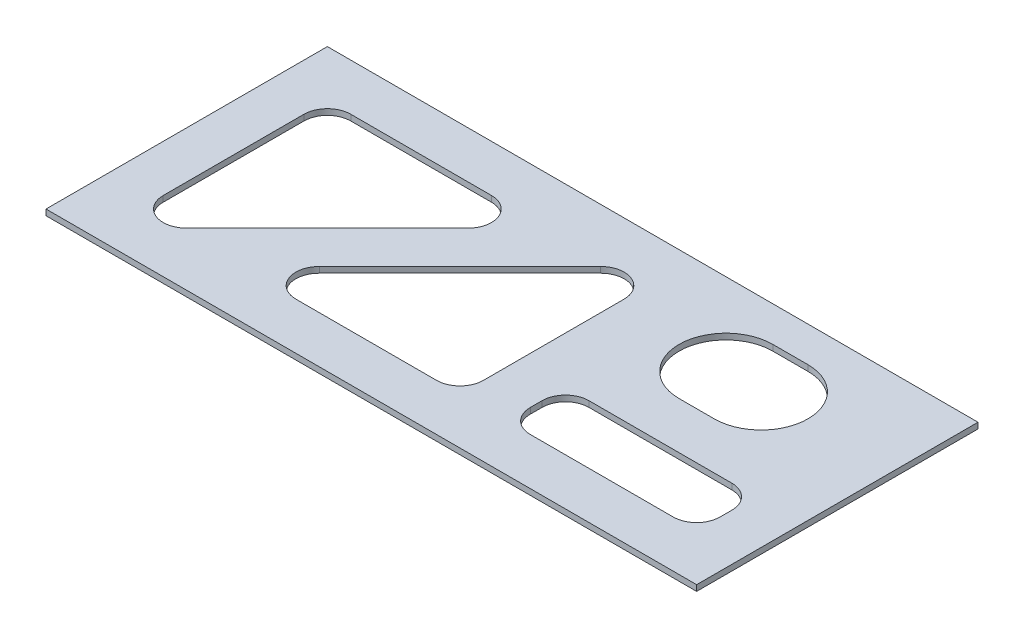
ISO-10303-21;
HEADER;
FILE_DESCRIPTION(('STEP AP214'),'2;1');
FILE_NAME('part.step','',(''),(''),'','','');
FILE_SCHEMA(('AUTOMOTIVE_DESIGN { 1 0 10303 214 1 1 1 1 }'));
ENDSEC;
DATA;
#1=APPLICATION_CONTEXT('core data for automotive mechanical design processes');
#2=APPLICATION_PROTOCOL_DEFINITION('international standard','automotive_design',2000,#1);
#3=PRODUCT_CONTEXT('',#1,'mechanical');
#4=PRODUCT('Part','Part','',(#3));
#5=PRODUCT_RELATED_PRODUCT_CATEGORY('part','',(#4));
#6=PRODUCT_DEFINITION_FORMATION('','',#4);
#7=PRODUCT_DEFINITION_CONTEXT('part definition',#1,'design');
#8=PRODUCT_DEFINITION('design','',#6,#7);
#9=PRODUCT_DEFINITION_SHAPE('','',#8);
#10=(LENGTH_UNIT() NAMED_UNIT(*) SI_UNIT(.MILLI.,.METRE.));
#11=(NAMED_UNIT(*) PLANE_ANGLE_UNIT() SI_UNIT($,.RADIAN.));
#12=(NAMED_UNIT(*) SI_UNIT($,.STERADIAN.) SOLID_ANGLE_UNIT());
#13=UNCERTAINTY_MEASURE_WITH_UNIT(LENGTH_MEASURE(1.E-05),#10,'distance_accuracy_value','');
#14=(GEOMETRIC_REPRESENTATION_CONTEXT(3) GLOBAL_UNCERTAINTY_ASSIGNED_CONTEXT((#13)) GLOBAL_UNIT_ASSIGNED_CONTEXT((#10,
#11,#12)) REPRESENTATION_CONTEXT('',''));
#15=CARTESIAN_POINT('',(0.,0.,0.));
#16=DIRECTION('',(0.,0.,1.));
#17=DIRECTION('',(1.,0.,0.));
#18=AXIS2_PLACEMENT_3D('',#15,#16,#17);
#19=CARTESIAN_POINT('',(-176.2125,1.5875,-76.1999999999999));
#20=DIRECTION('',(1.,0.,0.));
#21=DIRECTION('',(0.,0.,-1.));
#22=AXIS2_PLACEMENT_3D('',#19,#20,#21);
#23=PLANE('',#22);
#24=DIRECTION('',(0.,0.,1.));
#25=VECTOR('',#24,1.);
#26=CARTESIAN_POINT('',(-176.2125,-1.5875,-76.1999999999999));
#27=LINE('',#26,#25);
#28=CARTESIAN_POINT('',(-176.2125,-1.5875,-76.1999999999999));
#29=VERTEX_POINT('',#28);
#30=CARTESIAN_POINT('',(-176.2125,-1.5875,76.2000000000001));
#31=VERTEX_POINT('',#30);
#32=EDGE_CURVE('E453',#29,#31,#27,.T.);
#33=ORIENTED_EDGE('',*,*,#32,.T.);
#34=DIRECTION('',(0.,-1.,0.));
#35=VECTOR('',#34,1.);
#36=CARTESIAN_POINT('',(-176.2125,1.5875,76.2000000000001));
#37=LINE('',#36,#35);
#38=CARTESIAN_POINT('',(-176.2125,1.5875,76.2000000000001));
#39=VERTEX_POINT('',#38);
#40=EDGE_CURVE('E11',#39,#31,#37,.T.);
#41=ORIENTED_EDGE('',*,*,#40,.F.);
#42=DIRECTION('',(0.,0.,1.));
#43=VECTOR('',#42,1.);
#44=CARTESIAN_POINT('',(-176.2125,1.5875,-76.1999999999999));
#45=LINE('',#44,#43);
#46=CARTESIAN_POINT('',(-176.2125,1.5875,-76.1999999999999));
#47=VERTEX_POINT('',#46);
#48=EDGE_CURVE('E461',#47,#39,#45,.T.);
#49=ORIENTED_EDGE('',*,*,#48,.F.);
#50=DIRECTION('',(0.,-1.,0.));
#51=VECTOR('',#50,1.);
#52=CARTESIAN_POINT('',(-176.2125,1.5875,-76.1999999999999));
#53=LINE('',#52,#51);
#54=EDGE_CURVE('E473',#47,#29,#53,.T.);
#55=ORIENTED_EDGE('',*,*,#54,.T.);
#56=EDGE_LOOP('',(#33,#41,#49,#55));
#57=FACE_BOUND('',#56,.T.);
#58=ADVANCED_FACE('F39',(#57),#23,.F.);
#59=CARTESIAN_POINT('',(176.2125,1.5875,76.2));
#60=DIRECTION('',(0.,0.,-1.));
#61=DIRECTION('',(-1.,0.,0.));
#62=AXIS2_PLACEMENT_3D('',#59,#60,#61);
#63=PLANE('',#62);
#64=DIRECTION('',(1.,0.,0.));
#65=VECTOR('',#64,1.);
#66=CARTESIAN_POINT('',(176.2125,-1.5875,76.2));
#67=LINE('',#66,#65);
#68=CARTESIAN_POINT('',(176.2125,-1.5875,76.2));
#69=VERTEX_POINT('',#68);
#70=EDGE_CURVE('E476',#31,#69,#67,.T.);
#71=ORIENTED_EDGE('',*,*,#70,.T.);
#72=DIRECTION('',(0.,-1.,0.));
#73=VECTOR('',#72,1.);
#74=CARTESIAN_POINT('',(176.2125,1.5875,76.2));
#75=LINE('',#74,#73);
#76=CARTESIAN_POINT('',(176.2125,1.5875,76.2));
#77=VERTEX_POINT('',#76);
#78=EDGE_CURVE('E46',#77,#69,#75,.T.);
#79=ORIENTED_EDGE('',*,*,#78,.F.);
#80=DIRECTION('',(1.,0.,0.));
#81=VECTOR('',#80,1.);
#82=CARTESIAN_POINT('',(176.2125,1.5875,76.2));
#83=LINE('',#82,#81);
#84=EDGE_CURVE('E464',#39,#77,#83,.T.);
#85=ORIENTED_EDGE('',*,*,#84,.F.);
#86=ORIENTED_EDGE('',*,*,#40,.T.);
#87=EDGE_LOOP('',(#71,#79,#85,#86));
#88=FACE_BOUND('',#87,.T.);
#89=ADVANCED_FACE('F507',(#88),#63,.F.);
#90=CARTESIAN_POINT('',(176.2125,1.5875,-76.2));
#91=DIRECTION('',(-1.,0.,0.));
#92=DIRECTION('',(0.,0.,1.));
#93=AXIS2_PLACEMENT_3D('',#90,#91,#92);
#94=PLANE('',#93);
#95=DIRECTION('',(0.,0.,-1.));
#96=VECTOR('',#95,1.);
#97=CARTESIAN_POINT('',(176.2125,-1.5875,-76.2));
#98=LINE('',#97,#96);
#99=CARTESIAN_POINT('',(176.2125,-1.5875,-76.2));
#100=VERTEX_POINT('',#99);
#101=EDGE_CURVE('E479',#69,#100,#98,.T.);
#102=ORIENTED_EDGE('',*,*,#101,.T.);
#103=DIRECTION('',(0.,-1.,0.));
#104=VECTOR('',#103,1.);
#105=CARTESIAN_POINT('',(176.2125,1.5875,-76.2));
#106=LINE('',#105,#104);
#107=CARTESIAN_POINT('',(176.2125,1.5875,-76.2));
#108=VERTEX_POINT('',#107);
#109=EDGE_CURVE('E485',#108,#100,#106,.T.);
#110=ORIENTED_EDGE('',*,*,#109,.F.);
#111=DIRECTION('',(0.,0.,-1.));
#112=VECTOR('',#111,1.);
#113=CARTESIAN_POINT('',(176.2125,1.5875,-76.2));
#114=LINE('',#113,#112);
#115=EDGE_CURVE('E468',#77,#108,#114,.T.);
#116=ORIENTED_EDGE('',*,*,#115,.F.);
#117=ORIENTED_EDGE('',*,*,#78,.T.);
#118=EDGE_LOOP('',(#102,#110,#116,#117));
#119=FACE_BOUND('',#118,.T.);
#120=ADVANCED_FACE('F492',(#119),#94,.F.);
#121=CARTESIAN_POINT('',(176.2125,1.5875,-76.2));
#122=DIRECTION('',(0.,0.,1.));
#123=DIRECTION('',(1.,0.,0.));
#124=AXIS2_PLACEMENT_3D('',#121,#122,#123);
#125=PLANE('',#124);
#126=DIRECTION('',(-1.,0.,0.));
#127=VECTOR('',#126,1.);
#128=CARTESIAN_POINT('',(176.2125,-1.5875,-76.2));
#129=LINE('',#128,#127);
#130=EDGE_CURVE('E465',#100,#29,#129,.T.);
#131=ORIENTED_EDGE('',*,*,#130,.T.);
#132=ORIENTED_EDGE('',*,*,#54,.F.);
#133=DIRECTION('',(-1.,0.,0.));
#134=VECTOR('',#133,1.);
#135=CARTESIAN_POINT('',(176.2125,1.5875,-76.2));
#136=LINE('',#135,#134);
#137=EDGE_CURVE('E471',#108,#47,#136,.T.);
#138=ORIENTED_EDGE('',*,*,#137,.F.);
#139=ORIENTED_EDGE('',*,*,#109,.T.);
#140=EDGE_LOOP('',(#131,#132,#138,#139));
#141=FACE_BOUND('',#140,.T.);
#142=ADVANCED_FACE('F500',(#141),#125,.F.);
#143=CARTESIAN_POINT('',(-176.2125,1.5875,76.2000000000001));
#144=DIRECTION('',(0.,-1.,0.));
#145=DIRECTION('',(0.,0.,-1.));
#146=AXIS2_PLACEMENT_3D('',#143,#144,#145);
#147=PLANE('',#146);
#148=DIRECTION('',(1.,0.,0.));
#149=VECTOR('',#148,1.);
#150=CARTESIAN_POINT('',(60.7295489685521,1.5875,50.8000000000001));
#151=LINE('',#150,#149);
#152=CARTESIAN_POINT('',(60.729548968552,1.5875,50.8000000000001));
#153=VERTEX_POINT('',#152);
#154=CARTESIAN_POINT('',(138.1125,1.5875,50.8000000000001));
#155=VERTEX_POINT('',#154);
#156=EDGE_CURVE('E282',#153,#155,#151,.T.);
#157=ORIENTED_EDGE('',*,*,#156,.F.);
#158=CARTESIAN_POINT('',(60.7295489685521,1.5875,38.1000000000001));
#159=DIRECTION('',(0.,1.,0.));
#160=DIRECTION('',(0.,0.,1.));
#161=AXIS2_PLACEMENT_3D('',#158,#159,#160);
#162=CIRCLE('',#161,12.7);
#163=CARTESIAN_POINT('',(48.0295489685521,1.5875,38.1000000000001));
#164=VERTEX_POINT('',#163);
#165=EDGE_CURVE('E55',#164,#153,#162,.T.);
#166=ORIENTED_EDGE('',*,*,#165,.F.);
#167=DIRECTION('',(0.,0.,1.));
#168=VECTOR('',#167,1.);
#169=CARTESIAN_POINT('',(48.029548968552,1.5875,31.75));
#170=LINE('',#169,#168);
#171=CARTESIAN_POINT('',(48.029548968552,1.5875,31.75));
#172=VERTEX_POINT('',#171);
#173=EDGE_CURVE('E258',#172,#164,#170,.T.);
#174=ORIENTED_EDGE('',*,*,#173,.F.);
#175=CARTESIAN_POINT('',(60.7295489685521,1.5875,31.75));
#176=DIRECTION('',(0.,1.,0.));
#177=DIRECTION('',(0.,0.,1.));
#178=AXIS2_PLACEMENT_3D('',#175,#176,#177);
#179=CIRCLE('',#178,12.7);
#180=CARTESIAN_POINT('',(60.7295489685521,1.5875,19.05));
#181=VERTEX_POINT('',#180);
#182=EDGE_CURVE('E262',#181,#172,#179,.T.);
#183=ORIENTED_EDGE('',*,*,#182,.F.);
#184=DIRECTION('',(-1.,0.,0.));
#185=VECTOR('',#184,1.);
#186=CARTESIAN_POINT('',(138.1125,1.5875,19.05));
#187=LINE('',#186,#185);
#188=CARTESIAN_POINT('',(138.1125,1.5875,19.05));
#189=VERTEX_POINT('',#188);
#190=EDGE_CURVE('E296',#189,#181,#187,.T.);
#191=ORIENTED_EDGE('',*,*,#190,.F.);
#192=CARTESIAN_POINT('',(138.1125,1.5875,31.75));
#193=DIRECTION('',(0.,1.,0.));
#194=DIRECTION('',(0.,0.,1.));
#195=AXIS2_PLACEMENT_3D('',#192,#193,#194);
#196=CIRCLE('',#195,12.7);
#197=CARTESIAN_POINT('',(150.8125,1.5875,31.75));
#198=VERTEX_POINT('',#197);
#199=EDGE_CURVE('E292',#198,#189,#196,.T.);
#200=ORIENTED_EDGE('',*,*,#199,.F.);
#201=DIRECTION('',(0.,0.,-1.));
#202=VECTOR('',#201,1.);
#203=CARTESIAN_POINT('',(150.8125,1.5875,38.1000000000001));
#204=LINE('',#203,#202);
#205=CARTESIAN_POINT('',(150.8125,1.5875,38.1000000000001));
#206=VERTEX_POINT('',#205);
#207=EDGE_CURVE('E288',#206,#198,#204,.T.);
#208=ORIENTED_EDGE('',*,*,#207,.F.);
#209=CARTESIAN_POINT('',(138.1125,1.5875,38.1000000000001));
#210=DIRECTION('',(0.,1.,0.));
#211=DIRECTION('',(0.,0.,1.));
#212=AXIS2_PLACEMENT_3D('',#209,#210,#211);
#213=CIRCLE('',#212,12.7);
#214=EDGE_CURVE('E285',#155,#206,#213,.T.);
#215=ORIENTED_EDGE('',*,*,#214,.F.);
#216=EDGE_LOOP('',(#157,#166,#174,#183,#191,#200,#208,#215));
#217=FACE_BOUND('',#216,.T.);
#218=DIRECTION('',(0.,0.,-1.));
#219=VECTOR('',#218,1.);
#220=CARTESIAN_POINT('',(22.6295489685521,1.5875,38.1000000000001));
#221=LINE('',#220,#219);
#222=CARTESIAN_POINT('',(22.629548968552,1.5875,38.1000000000001));
#223=VERTEX_POINT('',#222);
#224=CARTESIAN_POINT('',(22.6295489685521,1.5875,-38.1));
#225=VERTEX_POINT('',#224);
#226=EDGE_CURVE('E343',#223,#225,#221,.T.);
#227=ORIENTED_EDGE('',*,*,#226,.F.);
#228=CARTESIAN_POINT('',(9.92954896855206,1.5875,38.1000000000001));
#229=DIRECTION('',(0.,1.,0.));
#230=DIRECTION('',(0.,0.,1.));
#231=AXIS2_PLACEMENT_3D('',#228,#229,#230);
#232=CIRCLE('',#231,12.7);
#233=CARTESIAN_POINT('',(9.92954896855206,1.5875,50.8000000000001));
#234=VERTEX_POINT('',#233);
#235=EDGE_CURVE('E304',#234,#223,#232,.T.);
#236=ORIENTED_EDGE('',*,*,#235,.F.);
#237=DIRECTION('',(1.,0.,0.));
#238=VECTOR('',#237,1.);
#239=CARTESIAN_POINT('',(-66.2704510314472,1.5875,50.8000000000001));
#240=LINE('',#239,#238);
#241=CARTESIAN_POINT('',(-66.2704510314472,1.5875,50.8000000000001));
#242=VERTEX_POINT('',#241);
#243=EDGE_CURVE('E323',#242,#234,#240,.T.);
#244=ORIENTED_EDGE('',*,*,#243,.F.);
#245=CARTESIAN_POINT('',(-66.2704510314472,1.5875,38.1000000000001));
#246=DIRECTION('',(0.,1.,0.));
#247=DIRECTION('',(0.,0.,1.));
#248=AXIS2_PLACEMENT_3D('',#245,#246,#247);
#249=CIRCLE('',#248,12.7);
#250=CARTESIAN_POINT('',(-75.2507071525164,1.5875,29.119743878931));
#251=VERTEX_POINT('',#250);
#252=EDGE_CURVE('E353',#251,#242,#249,.T.);
#253=ORIENTED_EDGE('',*,*,#252,.F.);
#254=DIRECTION('',(-0.707106781186544,0.,0.707106781186551));
#255=VECTOR('',#254,1.);
#256=CARTESIAN_POINT('',(0.949292847482843,1.5875,-47.0802561210691));
#257=LINE('',#256,#255);
#258=CARTESIAN_POINT('',(0.949292847482845,1.5875,-47.0802561210691));
#259=VERTEX_POINT('',#258);
#260=EDGE_CURVE('E350',#259,#251,#257,.T.);
#261=ORIENTED_EDGE('',*,*,#260,.F.);
#262=CARTESIAN_POINT('',(9.92954896855206,1.5875,-38.1));
#263=DIRECTION('',(0.,1.,0.));
#264=DIRECTION('',(0.,0.,1.));
#265=AXIS2_PLACEMENT_3D('',#262,#263,#264);
#266=CIRCLE('',#265,12.7);
#267=EDGE_CURVE('E347',#225,#259,#266,.T.);
#268=ORIENTED_EDGE('',*,*,#267,.F.);
#269=EDGE_LOOP('',(#227,#236,#244,#253,#261,#268));
#270=FACE_BOUND('',#269,.T.);
#271=DIRECTION('',(0.,0.,1.));
#272=VECTOR('',#271,1.);
#273=CARTESIAN_POINT('',(-150.8125,1.5875,38.1000000000001));
#274=LINE('',#273,#272);
#275=CARTESIAN_POINT('',(-150.8125,1.5875,-38.1));
#276=VERTEX_POINT('',#275);
#277=CARTESIAN_POINT('',(-150.8125,1.5875,38.1000000000001));
#278=VERTEX_POINT('',#277);
#279=EDGE_CURVE('E395',#276,#278,#274,.T.);
#280=ORIENTED_EDGE('',*,*,#279,.F.);
#281=CARTESIAN_POINT('',(-138.1125,1.5875,-38.1));
#282=DIRECTION('',(0.,1.,0.));
#283=DIRECTION('',(0.,0.,-1.));
#284=AXIS2_PLACEMENT_3D('',#281,#282,#283);
#285=CIRCLE('',#284,12.7);
#286=CARTESIAN_POINT('',(-138.1125,1.5875,-50.8));
#287=VERTEX_POINT('',#286);
#288=EDGE_CURVE('E362',#287,#276,#285,.T.);
#289=ORIENTED_EDGE('',*,*,#288,.F.);
#290=DIRECTION('',(-1.,0.,0.));
#291=VECTOR('',#290,1.);
#292=CARTESIAN_POINT('',(-138.1125,1.5875,-50.8));
#293=LINE('',#292,#291);
#294=CARTESIAN_POINT('',(-61.9125000000008,1.5875,-50.8));
#295=VERTEX_POINT('',#294);
#296=EDGE_CURVE('E378',#295,#287,#293,.T.);
#297=ORIENTED_EDGE('',*,*,#296,.F.);
#298=CARTESIAN_POINT('',(-61.9125000000008,1.5875,-38.1));
#299=DIRECTION('',(0.,1.,0.));
#300=DIRECTION('',(0.,0.,-1.));
#301=AXIS2_PLACEMENT_3D('',#298,#299,#300);
#302=CIRCLE('',#301,12.7);
#303=CARTESIAN_POINT('',(-52.9322438789316,1.5875,-29.1197438789309));
#304=VERTEX_POINT('',#303);
#305=EDGE_CURVE('E404',#304,#295,#302,.T.);
#306=ORIENTED_EDGE('',*,*,#305,.F.);
#307=DIRECTION('',(0.707106781186544,0.,-0.707106781186551));
#308=VECTOR('',#307,1.);
#309=CARTESIAN_POINT('',(-52.9322438789316,1.5875,-29.1197438789309));
#310=LINE('',#309,#308);
#311=CARTESIAN_POINT('',(-129.132243878931,1.5875,47.0802561210692));
#312=VERTEX_POINT('',#311);
#313=EDGE_CURVE('E401',#312,#304,#310,.T.);
#314=ORIENTED_EDGE('',*,*,#313,.F.);
#315=CARTESIAN_POINT('',(-138.1125,1.5875,38.1000000000001));
#316=DIRECTION('',(0.,1.,0.));
#317=DIRECTION('',(0.,0.,-1.));
#318=AXIS2_PLACEMENT_3D('',#315,#316,#317);
#319=CIRCLE('',#318,12.7);
#320=EDGE_CURVE('E398',#278,#312,#319,.T.);
#321=ORIENTED_EDGE('',*,*,#320,.F.);
#322=EDGE_LOOP('',(#280,#289,#297,#306,#314,#321));
#323=FACE_BOUND('',#322,.T.);
#324=DIRECTION('',(-1.,0.,0.));
#325=VECTOR('',#324,1.);
#326=CARTESIAN_POINT('',(103.1875,1.5875,-57.15));
#327=LINE('',#326,#325);
#328=CARTESIAN_POINT('',(103.1875,1.5875,-57.15));
#329=VERTEX_POINT('',#328);
#330=CARTESIAN_POINT('',(84.1375,1.5875,-57.15));
#331=VERTEX_POINT('',#330);
#332=EDGE_CURVE('E441',#329,#331,#327,.T.);
#333=ORIENTED_EDGE('',*,*,#332,.F.);
#334=CARTESIAN_POINT('',(103.1875,1.5875,-31.75));
#335=DIRECTION('',(0.,1.,0.));
#336=DIRECTION('',(0.,0.,1.));
#337=AXIS2_PLACEMENT_3D('',#334,#335,#336);
#338=CIRCLE('',#337,25.4);
#339=CARTESIAN_POINT('',(103.1875,1.5875,-6.35000000000002));
#340=VERTEX_POINT('',#339);
#341=EDGE_CURVE('E411',#340,#329,#338,.T.);
#342=ORIENTED_EDGE('',*,*,#341,.F.);
#343=DIRECTION('',(1.,0.,0.));
#344=VECTOR('',#343,1.);
#345=CARTESIAN_POINT('',(103.1875,1.5875,-6.35000000000002));
#346=LINE('',#345,#344);
#347=CARTESIAN_POINT('',(84.1375,1.5875,-6.35000000000001));
#348=VERTEX_POINT('',#347);
#349=EDGE_CURVE('E427',#348,#340,#346,.T.);
#350=ORIENTED_EDGE('',*,*,#349,.F.);
#351=CARTESIAN_POINT('',(84.1375,1.5875,-31.75));
#352=DIRECTION('',(0.,1.,0.));
#353=DIRECTION('',(0.,0.,1.));
#354=AXIS2_PLACEMENT_3D('',#351,#352,#353);
#355=CIRCLE('',#354,25.4);
#356=EDGE_CURVE('E444',#331,#348,#355,.T.);
#357=ORIENTED_EDGE('',*,*,#356,.F.);
#358=EDGE_LOOP('',(#333,#342,#350,#357));
#359=FACE_BOUND('',#358,.T.);
#360=ORIENTED_EDGE('',*,*,#48,.T.);
#361=ORIENTED_EDGE('',*,*,#84,.T.);
#362=ORIENTED_EDGE('',*,*,#115,.T.);
#363=ORIENTED_EDGE('',*,*,#137,.T.);
#364=EDGE_LOOP('',(#360,#361,#362,#363));
#365=FACE_BOUND('',#364,.T.);
#366=ADVANCED_FACE('F506',(#217,#270,#323,#359,#365),#147,.F.);
#367=CARTESIAN_POINT('',(-176.2125,-1.5875,76.2000000000001));
#368=DIRECTION('',(0.,-1.,0.));
#369=DIRECTION('',(0.,0.,-1.));
#370=AXIS2_PLACEMENT_3D('',#367,#368,#369);
#371=PLANE('',#370);
#372=CARTESIAN_POINT('',(60.7295489685521,-1.5875,38.1000000000001));
#373=DIRECTION('',(0.,1.,0.));
#374=DIRECTION('',(0.,0.,1.));
#375=AXIS2_PLACEMENT_3D('',#372,#373,#374);
#376=CIRCLE('',#375,12.7);
#377=CARTESIAN_POINT('',(48.0295489685521,-1.5875,38.1000000000001));
#378=VERTEX_POINT('',#377);
#379=CARTESIAN_POINT('',(60.7295489685521,-1.5875,50.8000000000001));
#380=VERTEX_POINT('',#379);
#381=EDGE_CURVE('E238',#378,#380,#376,.T.);
#382=ORIENTED_EDGE('',*,*,#381,.T.);
#383=DIRECTION('',(1.,0.,0.));
#384=VECTOR('',#383,1.);
#385=CARTESIAN_POINT('',(60.7295489685521,-1.5875,50.8000000000001));
#386=LINE('',#385,#384);
#387=CARTESIAN_POINT('',(138.1125,-1.5875,50.8000000000001));
#388=VERTEX_POINT('',#387);
#389=EDGE_CURVE('E248',#380,#388,#386,.T.);
#390=ORIENTED_EDGE('',*,*,#389,.T.);
#391=CARTESIAN_POINT('',(138.1125,-1.5875,38.1000000000001));
#392=DIRECTION('',(0.,1.,0.));
#393=DIRECTION('',(0.,0.,1.));
#394=AXIS2_PLACEMENT_3D('',#391,#392,#393);
#395=CIRCLE('',#394,12.7);
#396=CARTESIAN_POINT('',(150.8125,-1.5875,38.1000000000001));
#397=VERTEX_POINT('',#396);
#398=EDGE_CURVE('E63',#388,#397,#395,.T.);
#399=ORIENTED_EDGE('',*,*,#398,.T.);
#400=DIRECTION('',(0.,0.,-1.));
#401=VECTOR('',#400,1.);
#402=CARTESIAN_POINT('',(150.8125,-1.5875,38.1000000000001));
#403=LINE('',#402,#401);
#404=CARTESIAN_POINT('',(150.8125,-1.5875,31.75));
#405=VERTEX_POINT('',#404);
#406=EDGE_CURVE('E266',#397,#405,#403,.T.);
#407=ORIENTED_EDGE('',*,*,#406,.T.);
#408=CARTESIAN_POINT('',(138.1125,-1.5875,31.75));
#409=DIRECTION('',(0.,1.,0.));
#410=DIRECTION('',(0.,0.,1.));
#411=AXIS2_PLACEMENT_3D('',#408,#409,#410);
#412=CIRCLE('',#411,12.7);
#413=CARTESIAN_POINT('',(138.1125,-1.5875,19.05));
#414=VERTEX_POINT('',#413);
#415=EDGE_CURVE('E270',#405,#414,#412,.T.);
#416=ORIENTED_EDGE('',*,*,#415,.T.);
#417=DIRECTION('',(-1.,0.,0.));
#418=VECTOR('',#417,1.);
#419=CARTESIAN_POINT('',(138.1125,-1.5875,19.05));
#420=LINE('',#419,#418);
#421=CARTESIAN_POINT('',(60.7295489685521,-1.5875,19.05));
#422=VERTEX_POINT('',#421);
#423=EDGE_CURVE('E274',#414,#422,#420,.T.);
#424=ORIENTED_EDGE('',*,*,#423,.T.);
#425=CARTESIAN_POINT('',(60.7295489685521,-1.5875,31.75));
#426=DIRECTION('',(0.,1.,0.));
#427=DIRECTION('',(0.,0.,1.));
#428=AXIS2_PLACEMENT_3D('',#425,#426,#427);
#429=CIRCLE('',#428,12.7);
#430=CARTESIAN_POINT('',(48.029548968552,-1.5875,31.75));
#431=VERTEX_POINT('',#430);
#432=EDGE_CURVE('E278',#422,#431,#429,.T.);
#433=ORIENTED_EDGE('',*,*,#432,.T.);
#434=DIRECTION('',(0.,0.,1.));
#435=VECTOR('',#434,1.);
#436=CARTESIAN_POINT('',(48.029548968552,-1.5875,31.75));
#437=LINE('',#436,#435);
#438=EDGE_CURVE('E245',#431,#378,#437,.T.);
#439=ORIENTED_EDGE('',*,*,#438,.T.);
#440=EDGE_LOOP('',(#382,#390,#399,#407,#416,#424,#433,#439));
#441=FACE_BOUND('',#440,.T.);
#442=CARTESIAN_POINT('',(9.92954896855206,-1.5875,38.1000000000001));
#443=DIRECTION('',(0.,1.,0.));
#444=DIRECTION('',(0.,0.,1.));
#445=AXIS2_PLACEMENT_3D('',#442,#443,#444);
#446=CIRCLE('',#445,12.7);
#447=CARTESIAN_POINT('',(9.92954896855206,-1.5875,50.8000000000001));
#448=VERTEX_POINT('',#447);
#449=CARTESIAN_POINT('',(22.6295489685521,-1.5875,38.1000000000001));
#450=VERTEX_POINT('',#449);
#451=EDGE_CURVE('E318',#448,#450,#446,.T.);
#452=ORIENTED_EDGE('',*,*,#451,.T.);
#453=DIRECTION('',(0.,0.,-1.));
#454=VECTOR('',#453,1.);
#455=CARTESIAN_POINT('',(22.6295489685521,-1.5875,38.1000000000001));
#456=LINE('',#455,#454);
#457=CARTESIAN_POINT('',(22.629548968552,-1.5875,-38.1));
#458=VERTEX_POINT('',#457);
#459=EDGE_CURVE('E322',#450,#458,#456,.T.);
#460=ORIENTED_EDGE('',*,*,#459,.T.);
#461=CARTESIAN_POINT('',(9.92954896855206,-1.5875,-38.1));
#462=DIRECTION('',(0.,1.,0.));
#463=DIRECTION('',(0.,0.,1.));
#464=AXIS2_PLACEMENT_3D('',#461,#462,#463);
#465=CIRCLE('',#464,12.7);
#466=CARTESIAN_POINT('',(0.949292847482845,-1.5875,-47.0802561210691));
#467=VERTEX_POINT('',#466);
#468=EDGE_CURVE('E327',#458,#467,#465,.T.);
#469=ORIENTED_EDGE('',*,*,#468,.T.);
#470=DIRECTION('',(-0.707106781186544,0.,0.707106781186551));
#471=VECTOR('',#470,1.);
#472=CARTESIAN_POINT('',(0.949292847482843,-1.5875,-47.0802561210691));
#473=LINE('',#472,#471);
#474=CARTESIAN_POINT('',(-75.2507071525164,-1.5875,29.119743878931));
#475=VERTEX_POINT('',#474);
#476=EDGE_CURVE('E330',#467,#475,#473,.T.);
#477=ORIENTED_EDGE('',*,*,#476,.T.);
#478=CARTESIAN_POINT('',(-66.2704510314472,-1.5875,38.1000000000001));
#479=DIRECTION('',(0.,1.,0.));
#480=DIRECTION('',(0.,0.,1.));
#481=AXIS2_PLACEMENT_3D('',#478,#479,#480);
#482=CIRCLE('',#481,12.7);
#483=CARTESIAN_POINT('',(-66.2704510314472,-1.5875,50.8000000000001));
#484=VERTEX_POINT('',#483);
#485=EDGE_CURVE('E333',#475,#484,#482,.T.);
#486=ORIENTED_EDGE('',*,*,#485,.T.);
#487=DIRECTION('',(1.,0.,0.));
#488=VECTOR('',#487,1.);
#489=CARTESIAN_POINT('',(-66.2704510314472,-1.5875,50.8000000000001));
#490=LINE('',#489,#488);
#491=EDGE_CURVE('E336',#484,#448,#490,.T.);
#492=ORIENTED_EDGE('',*,*,#491,.T.);
#493=EDGE_LOOP('',(#452,#460,#469,#477,#486,#492));
#494=FACE_BOUND('',#493,.T.);
#495=CARTESIAN_POINT('',(-138.1125,-1.5875,-38.1));
#496=DIRECTION('',(0.,1.,0.));
#497=DIRECTION('',(0.,0.,-1.));
#498=AXIS2_PLACEMENT_3D('',#495,#496,#497);
#499=CIRCLE('',#498,12.7);
#500=CARTESIAN_POINT('',(-138.1125,-1.5875,-50.8));
#501=VERTEX_POINT('',#500);
#502=CARTESIAN_POINT('',(-150.8125,-1.5875,-38.1));
#503=VERTEX_POINT('',#502);
#504=EDGE_CURVE('E374',#501,#503,#499,.T.);
#505=ORIENTED_EDGE('',*,*,#504,.T.);
#506=DIRECTION('',(0.,0.,1.));
#507=VECTOR('',#506,1.);
#508=CARTESIAN_POINT('',(-150.8125,-1.5875,38.1000000000001));
#509=LINE('',#508,#507);
#510=CARTESIAN_POINT('',(-150.8125,-1.5875,38.1000000000001));
#511=VERTEX_POINT('',#510);
#512=EDGE_CURVE('E377',#503,#511,#509,.T.);
#513=ORIENTED_EDGE('',*,*,#512,.T.);
#514=CARTESIAN_POINT('',(-138.1125,-1.5875,38.1000000000001));
#515=DIRECTION('',(0.,1.,0.));
#516=DIRECTION('',(0.,0.,-1.));
#517=AXIS2_PLACEMENT_3D('',#514,#515,#516);
#518=CIRCLE('',#517,12.7);
#519=CARTESIAN_POINT('',(-129.132243878931,-1.5875,47.0802561210692));
#520=VERTEX_POINT('',#519);
#521=EDGE_CURVE('E381',#511,#520,#518,.T.);
#522=ORIENTED_EDGE('',*,*,#521,.T.);
#523=DIRECTION('',(0.707106781186544,0.,-0.707106781186551));
#524=VECTOR('',#523,1.);
#525=CARTESIAN_POINT('',(-52.9322438789316,-1.5875,-29.1197438789309));
#526=LINE('',#525,#524);
#527=CARTESIAN_POINT('',(-52.9322438789316,-1.5875,-29.1197438789309));
#528=VERTEX_POINT('',#527);
#529=EDGE_CURVE('E384',#520,#528,#526,.T.);
#530=ORIENTED_EDGE('',*,*,#529,.T.);
#531=CARTESIAN_POINT('',(-61.9125000000008,-1.5875,-38.1));
#532=DIRECTION('',(0.,1.,0.));
#533=DIRECTION('',(0.,0.,-1.));
#534=AXIS2_PLACEMENT_3D('',#531,#532,#533);
#535=CIRCLE('',#534,12.7);
#536=CARTESIAN_POINT('',(-61.9125000000008,-1.5875,-50.8));
#537=VERTEX_POINT('',#536);
#538=EDGE_CURVE('E387',#528,#537,#535,.T.);
#539=ORIENTED_EDGE('',*,*,#538,.T.);
#540=DIRECTION('',(-1.,0.,0.));
#541=VECTOR('',#540,1.);
#542=CARTESIAN_POINT('',(-138.1125,-1.5875,-50.8));
#543=LINE('',#542,#541);
#544=EDGE_CURVE('E390',#537,#501,#543,.T.);
#545=ORIENTED_EDGE('',*,*,#544,.T.);
#546=EDGE_LOOP('',(#505,#513,#522,#530,#539,#545));
#547=FACE_BOUND('',#546,.T.);
#548=CARTESIAN_POINT('',(103.1875,-1.5875,-31.75));
#549=DIRECTION('',(0.,1.,0.));
#550=DIRECTION('',(0.,0.,1.));
#551=AXIS2_PLACEMENT_3D('',#548,#549,#550);
#552=CIRCLE('',#551,25.4);
#553=CARTESIAN_POINT('',(103.1875,-1.5875,-6.35000000000002));
#554=VERTEX_POINT('',#553);
#555=CARTESIAN_POINT('',(103.1875,-1.5875,-57.15));
#556=VERTEX_POINT('',#555);
#557=EDGE_CURVE('E422',#554,#556,#552,.T.);
#558=ORIENTED_EDGE('',*,*,#557,.T.);
#559=DIRECTION('',(-1.,0.,0.));
#560=VECTOR('',#559,1.);
#561=CARTESIAN_POINT('',(103.1875,-1.5875,-57.15));
#562=LINE('',#561,#560);
#563=CARTESIAN_POINT('',(84.1375,-1.5875,-57.15));
#564=VERTEX_POINT('',#563);
#565=EDGE_CURVE('E426',#556,#564,#562,.T.);
#566=ORIENTED_EDGE('',*,*,#565,.T.);
#567=CARTESIAN_POINT('',(84.1375,-1.5875,-31.75));
#568=DIRECTION('',(0.,1.,0.));
#569=DIRECTION('',(0.,0.,1.));
#570=AXIS2_PLACEMENT_3D('',#567,#568,#569);
#571=CIRCLE('',#570,25.4);
#572=CARTESIAN_POINT('',(84.1375,-1.5875,-6.35000000000001));
#573=VERTEX_POINT('',#572);
#574=EDGE_CURVE('E430',#564,#573,#571,.T.);
#575=ORIENTED_EDGE('',*,*,#574,.T.);
#576=DIRECTION('',(1.,0.,0.));
#577=VECTOR('',#576,1.);
#578=CARTESIAN_POINT('',(103.1875,-1.5875,-6.35000000000002));
#579=LINE('',#578,#577);
#580=EDGE_CURVE('E434',#573,#554,#579,.T.);
#581=ORIENTED_EDGE('',*,*,#580,.T.);
#582=EDGE_LOOP('',(#558,#566,#575,#581));
#583=FACE_BOUND('',#582,.T.);
#584=ORIENTED_EDGE('',*,*,#32,.F.);
#585=ORIENTED_EDGE('',*,*,#130,.F.);
#586=ORIENTED_EDGE('',*,*,#101,.F.);
#587=ORIENTED_EDGE('',*,*,#70,.F.);
#588=EDGE_LOOP('',(#584,#585,#586,#587));
#589=FACE_BOUND('',#588,.T.);
#590=ADVANCED_FACE('F253',(#441,#494,#547,#583,#589),#371,.T.);
#591=CARTESIAN_POINT('',(103.1875,-1.5875,-31.75));
#592=DIRECTION('',(0.,1.,0.));
#593=DIRECTION('',(0.,0.,1.));
#594=AXIS2_PLACEMENT_3D('',#591,#592,#593);
#595=CYLINDRICAL_SURFACE('',#594,25.4);
#596=ORIENTED_EDGE('',*,*,#341,.T.);
#597=DIRECTION('',(0.,1.,0.));
#598=VECTOR('',#597,1.);
#599=CARTESIAN_POINT('',(103.1875,-1.5875,-57.15));
#600=LINE('',#599,#598);
#601=EDGE_CURVE('E438',#556,#329,#600,.T.);
#602=ORIENTED_EDGE('',*,*,#601,.F.);
#603=ORIENTED_EDGE('',*,*,#557,.F.);
#604=DIRECTION('',(0.,1.,0.));
#605=VECTOR('',#604,1.);
#606=CARTESIAN_POINT('',(103.1875,-1.5875,-6.35000000000002));
#607=LINE('',#606,#605);
#608=EDGE_CURVE('E450',#554,#340,#607,.T.);
#609=ORIENTED_EDGE('',*,*,#608,.T.);
#610=EDGE_LOOP('',(#596,#602,#603,#609));
#611=FACE_BOUND('',#610,.T.);
#612=ADVANCED_FACE('F519',(#611),#595,.F.);
#613=CARTESIAN_POINT('',(103.1875,-1.5875,-6.35000000000002));
#614=DIRECTION('',(0.,0.,1.));
#615=DIRECTION('',(1.,0.,0.));
#616=AXIS2_PLACEMENT_3D('',#613,#614,#615);
#617=PLANE('',#616);
#618=ORIENTED_EDGE('',*,*,#349,.T.);
#619=ORIENTED_EDGE('',*,*,#608,.F.);
#620=ORIENTED_EDGE('',*,*,#580,.F.);
#621=DIRECTION('',(0.,1.,0.));
#622=VECTOR('',#621,1.);
#623=CARTESIAN_POINT('',(84.1375,-1.5875,-6.35000000000001));
#624=LINE('',#623,#622);
#625=EDGE_CURVE('E454',#573,#348,#624,.T.);
#626=ORIENTED_EDGE('',*,*,#625,.T.);
#627=EDGE_LOOP('',(#618,#619,#620,#626));
#628=FACE_BOUND('',#627,.T.);
#629=ADVANCED_FACE('F525',(#628),#617,.F.);
#630=CARTESIAN_POINT('',(84.1375,-1.5875,-31.75));
#631=DIRECTION('',(0.,1.,0.));
#632=DIRECTION('',(0.,0.,1.));
#633=AXIS2_PLACEMENT_3D('',#630,#631,#632);
#634=CYLINDRICAL_SURFACE('',#633,25.4);
#635=ORIENTED_EDGE('',*,*,#356,.T.);
#636=ORIENTED_EDGE('',*,*,#625,.F.);
#637=ORIENTED_EDGE('',*,*,#574,.F.);
#638=DIRECTION('',(0.,1.,0.));
#639=VECTOR('',#638,1.);
#640=CARTESIAN_POINT('',(84.1375,-1.5875,-57.15));
#641=LINE('',#640,#639);
#642=EDGE_CURVE('E457',#564,#331,#641,.T.);
#643=ORIENTED_EDGE('',*,*,#642,.T.);
#644=EDGE_LOOP('',(#635,#636,#637,#643));
#645=FACE_BOUND('',#644,.T.);
#646=ADVANCED_FACE('F531',(#645),#634,.F.);
#647=CARTESIAN_POINT('',(103.1875,-1.5875,-57.15));
#648=DIRECTION('',(0.,0.,-1.));
#649=DIRECTION('',(-1.,0.,0.));
#650=AXIS2_PLACEMENT_3D('',#647,#648,#649);
#651=PLANE('',#650);
#652=ORIENTED_EDGE('',*,*,#332,.T.);
#653=ORIENTED_EDGE('',*,*,#642,.F.);
#654=ORIENTED_EDGE('',*,*,#565,.F.);
#655=ORIENTED_EDGE('',*,*,#601,.T.);
#656=EDGE_LOOP('',(#652,#653,#654,#655));
#657=FACE_BOUND('',#656,.T.);
#658=ADVANCED_FACE('F527',(#657),#651,.F.);
#659=CARTESIAN_POINT('',(-138.1125,-1.5875,-38.1));
#660=DIRECTION('',(0.,1.,0.));
#661=DIRECTION('',(0.,0.,1.));
#662=AXIS2_PLACEMENT_3D('',#659,#660,#661);
#663=CYLINDRICAL_SURFACE('',#662,12.7);
#664=ORIENTED_EDGE('',*,*,#288,.T.);
#665=DIRECTION('',(0.,1.,0.));
#666=VECTOR('',#665,1.);
#667=CARTESIAN_POINT('',(-150.8125,-1.5875,-38.1));
#668=LINE('',#667,#666);
#669=EDGE_CURVE('E393',#503,#276,#668,.T.);
#670=ORIENTED_EDGE('',*,*,#669,.F.);
#671=ORIENTED_EDGE('',*,*,#504,.F.);
#672=DIRECTION('',(0.,1.,0.));
#673=VECTOR('',#672,1.);
#674=CARTESIAN_POINT('',(-138.1125,-1.5875,-50.8));
#675=LINE('',#674,#673);
#676=EDGE_CURVE('E409',#501,#287,#675,.T.);
#677=ORIENTED_EDGE('',*,*,#676,.T.);
#678=EDGE_LOOP('',(#664,#670,#671,#677));
#679=FACE_BOUND('',#678,.T.);
#680=ADVANCED_FACE('F530',(#679),#663,.F.);
#681=CARTESIAN_POINT('',(-138.1125,-1.5875,-50.8));
#682=DIRECTION('',(0.,0.,-1.));
#683=DIRECTION('',(-1.,0.,0.));
#684=AXIS2_PLACEMENT_3D('',#681,#682,#683);
#685=PLANE('',#684);
#686=ORIENTED_EDGE('',*,*,#296,.T.);
#687=ORIENTED_EDGE('',*,*,#676,.F.);
#688=ORIENTED_EDGE('',*,*,#544,.F.);
#689=DIRECTION('',(0.,1.,0.));
#690=VECTOR('',#689,1.);
#691=CARTESIAN_POINT('',(-61.9125000000008,-1.5875,-50.8));
#692=LINE('',#691,#690);
#693=EDGE_CURVE('E412',#537,#295,#692,.T.);
#694=ORIENTED_EDGE('',*,*,#693,.T.);
#695=EDGE_LOOP('',(#686,#687,#688,#694));
#696=FACE_BOUND('',#695,.T.);
#697=ADVANCED_FACE('F541',(#696),#685,.F.);
#698=CARTESIAN_POINT('',(-61.9125000000008,-1.5875,-38.1));
#699=DIRECTION('',(0.,1.,0.));
#700=DIRECTION('',(0.,0.,1.));
#701=AXIS2_PLACEMENT_3D('',#698,#699,#700);
#702=CYLINDRICAL_SURFACE('',#701,12.7);
#703=ORIENTED_EDGE('',*,*,#305,.T.);
#704=ORIENTED_EDGE('',*,*,#693,.F.);
#705=ORIENTED_EDGE('',*,*,#538,.F.);
#706=DIRECTION('',(0.,1.,0.));
#707=VECTOR('',#706,1.);
#708=CARTESIAN_POINT('',(-52.9322438789316,-1.5875,-29.1197438789309));
#709=LINE('',#708,#707);
#710=EDGE_CURVE('E414',#528,#304,#709,.T.);
#711=ORIENTED_EDGE('',*,*,#710,.T.);
#712=EDGE_LOOP('',(#703,#704,#705,#711));
#713=FACE_BOUND('',#712,.T.);
#714=ADVANCED_FACE('F555',(#713),#702,.F.);
#715=CARTESIAN_POINT('',(-52.9322438789316,-1.5875,-29.1197438789309));
#716=DIRECTION('',(0.707106781186551,0.,0.707106781186544));
#717=DIRECTION('',(0.707106781186544,0.,-0.707106781186551));
#718=AXIS2_PLACEMENT_3D('',#715,#716,#717);
#719=PLANE('',#718);
#720=ORIENTED_EDGE('',*,*,#313,.T.);
#721=ORIENTED_EDGE('',*,*,#710,.F.);
#722=ORIENTED_EDGE('',*,*,#529,.F.);
#723=DIRECTION('',(0.,1.,0.));
#724=VECTOR('',#723,1.);
#725=CARTESIAN_POINT('',(-129.132243878931,-1.5875,47.0802561210692));
#726=LINE('',#725,#724);
#727=EDGE_CURVE('E416',#520,#312,#726,.T.);
#728=ORIENTED_EDGE('',*,*,#727,.T.);
#729=EDGE_LOOP('',(#720,#721,#722,#728));
#730=FACE_BOUND('',#729,.T.);
#731=ADVANCED_FACE('F551',(#730),#719,.F.);
#732=CARTESIAN_POINT('',(-138.1125,-1.5875,38.1000000000001));
#733=DIRECTION('',(0.,1.,0.));
#734=DIRECTION('',(0.,0.,1.));
#735=AXIS2_PLACEMENT_3D('',#732,#733,#734);
#736=CYLINDRICAL_SURFACE('',#735,12.7);
#737=ORIENTED_EDGE('',*,*,#320,.T.);
#738=ORIENTED_EDGE('',*,*,#727,.F.);
#739=ORIENTED_EDGE('',*,*,#521,.F.);
#740=DIRECTION('',(0.,1.,0.));
#741=VECTOR('',#740,1.);
#742=CARTESIAN_POINT('',(-150.8125,-1.5875,38.1000000000001));
#743=LINE('',#742,#741);
#744=EDGE_CURVE('E418',#511,#278,#743,.T.);
#745=ORIENTED_EDGE('',*,*,#744,.T.);
#746=EDGE_LOOP('',(#737,#738,#739,#745));
#747=FACE_BOUND('',#746,.T.);
#748=ADVANCED_FACE('F547',(#747),#736,.F.);
#749=CARTESIAN_POINT('',(-150.8125,-1.5875,38.1000000000001));
#750=DIRECTION('',(-1.,0.,0.));
#751=DIRECTION('',(0.,0.,1.));
#752=AXIS2_PLACEMENT_3D('',#749,#750,#751);
#753=PLANE('',#752);
#754=ORIENTED_EDGE('',*,*,#279,.T.);
#755=ORIENTED_EDGE('',*,*,#744,.F.);
#756=ORIENTED_EDGE('',*,*,#512,.F.);
#757=ORIENTED_EDGE('',*,*,#669,.T.);
#758=EDGE_LOOP('',(#754,#755,#756,#757));
#759=FACE_BOUND('',#758,.T.);
#760=ADVANCED_FACE('F543',(#759),#753,.F.);
#761=CARTESIAN_POINT('',(9.92954896855206,-1.5875,38.1000000000001));
#762=DIRECTION('',(0.,1.,0.));
#763=DIRECTION('',(0.,0.,1.));
#764=AXIS2_PLACEMENT_3D('',#761,#762,#763);
#765=CYLINDRICAL_SURFACE('',#764,12.7);
#766=ORIENTED_EDGE('',*,*,#235,.T.);
#767=DIRECTION('',(0.,1.,0.));
#768=VECTOR('',#767,1.);
#769=CARTESIAN_POINT('',(22.6295489685521,-1.5875,38.1000000000001));
#770=LINE('',#769,#768);
#771=EDGE_CURVE('E340',#450,#223,#770,.T.);
#772=ORIENTED_EDGE('',*,*,#771,.F.);
#773=ORIENTED_EDGE('',*,*,#451,.F.);
#774=DIRECTION('',(0.,1.,0.));
#775=VECTOR('',#774,1.);
#776=CARTESIAN_POINT('',(9.92954896855206,-1.5875,50.8000000000001));
#777=LINE('',#776,#775);
#778=EDGE_CURVE('E359',#448,#234,#777,.T.);
#779=ORIENTED_EDGE('',*,*,#778,.T.);
#780=EDGE_LOOP('',(#766,#772,#773,#779));
#781=FACE_BOUND('',#780,.T.);
#782=ADVANCED_FACE('F546',(#781),#765,.F.);
#783=CARTESIAN_POINT('',(-66.2704510314472,-1.5875,50.8000000000001));
#784=DIRECTION('',(0.,0.,1.));
#785=DIRECTION('',(1.,0.,0.));
#786=AXIS2_PLACEMENT_3D('',#783,#784,#785);
#787=PLANE('',#786);
#788=ORIENTED_EDGE('',*,*,#243,.T.);
#789=ORIENTED_EDGE('',*,*,#778,.F.);
#790=ORIENTED_EDGE('',*,*,#491,.F.);
#791=DIRECTION('',(0.,1.,0.));
#792=VECTOR('',#791,1.);
#793=CARTESIAN_POINT('',(-66.2704510314472,-1.5875,50.8000000000001));
#794=LINE('',#793,#792);
#795=EDGE_CURVE('E363',#484,#242,#794,.T.);
#796=ORIENTED_EDGE('',*,*,#795,.T.);
#797=EDGE_LOOP('',(#788,#789,#790,#796));
#798=FACE_BOUND('',#797,.T.);
#799=ADVANCED_FACE('F565',(#798),#787,.F.);
#800=CARTESIAN_POINT('',(-66.2704510314472,-1.5875,38.1000000000001));
#801=DIRECTION('',(0.,1.,0.));
#802=DIRECTION('',(0.,0.,1.));
#803=AXIS2_PLACEMENT_3D('',#800,#801,#802);
#804=CYLINDRICAL_SURFACE('',#803,12.7);
#805=ORIENTED_EDGE('',*,*,#252,.T.);
#806=ORIENTED_EDGE('',*,*,#795,.F.);
#807=ORIENTED_EDGE('',*,*,#485,.F.);
#808=DIRECTION('',(0.,1.,0.));
#809=VECTOR('',#808,1.);
#810=CARTESIAN_POINT('',(-75.2507071525164,-1.5875,29.119743878931));
#811=LINE('',#810,#809);
#812=EDGE_CURVE('E365',#475,#251,#811,.T.);
#813=ORIENTED_EDGE('',*,*,#812,.T.);
#814=EDGE_LOOP('',(#805,#806,#807,#813));
#815=FACE_BOUND('',#814,.T.);
#816=ADVANCED_FACE('F578',(#815),#804,.F.);
#817=CARTESIAN_POINT('',(0.949292847482843,-1.5875,-47.0802561210691));
#818=DIRECTION('',(-0.707106781186551,0.,-0.707106781186544));
#819=DIRECTION('',(-0.707106781186544,0.,0.707106781186551));
#820=AXIS2_PLACEMENT_3D('',#817,#818,#819);
#821=PLANE('',#820);
#822=ORIENTED_EDGE('',*,*,#260,.T.);
#823=ORIENTED_EDGE('',*,*,#812,.F.);
#824=ORIENTED_EDGE('',*,*,#476,.F.);
#825=DIRECTION('',(0.,1.,0.));
#826=VECTOR('',#825,1.);
#827=CARTESIAN_POINT('',(0.949292847482845,-1.5875,-47.0802561210691));
#828=LINE('',#827,#826);
#829=EDGE_CURVE('E367',#467,#259,#828,.T.);
#830=ORIENTED_EDGE('',*,*,#829,.T.);
#831=EDGE_LOOP('',(#822,#823,#824,#830));
#832=FACE_BOUND('',#831,.T.);
#833=ADVANCED_FACE('F574',(#832),#821,.F.);
#834=CARTESIAN_POINT('',(9.92954896855206,-1.5875,-38.1));
#835=DIRECTION('',(0.,1.,0.));
#836=DIRECTION('',(0.,0.,1.));
#837=AXIS2_PLACEMENT_3D('',#834,#835,#836);
#838=CYLINDRICAL_SURFACE('',#837,12.7);
#839=ORIENTED_EDGE('',*,*,#267,.T.);
#840=ORIENTED_EDGE('',*,*,#829,.F.);
#841=ORIENTED_EDGE('',*,*,#468,.F.);
#842=DIRECTION('',(0.,1.,0.));
#843=VECTOR('',#842,1.);
#844=CARTESIAN_POINT('',(22.6295489685521,-1.5875,-38.1));
#845=LINE('',#844,#843);
#846=EDGE_CURVE('E369',#458,#225,#845,.T.);
#847=ORIENTED_EDGE('',*,*,#846,.T.);
#848=EDGE_LOOP('',(#839,#840,#841,#847));
#849=FACE_BOUND('',#848,.T.);
#850=ADVANCED_FACE('F570',(#849),#838,.F.);
#851=CARTESIAN_POINT('',(22.6295489685521,-1.5875,38.1000000000001));
#852=DIRECTION('',(1.,0.,0.));
#853=DIRECTION('',(0.,0.,-1.));
#854=AXIS2_PLACEMENT_3D('',#851,#852,#853);
#855=PLANE('',#854);
#856=ORIENTED_EDGE('',*,*,#226,.T.);
#857=ORIENTED_EDGE('',*,*,#846,.F.);
#858=ORIENTED_EDGE('',*,*,#459,.F.);
#859=ORIENTED_EDGE('',*,*,#771,.T.);
#860=EDGE_LOOP('',(#856,#857,#858,#859));
#861=FACE_BOUND('',#860,.T.);
#862=ADVANCED_FACE('F567',(#861),#855,.F.);
#863=CARTESIAN_POINT('',(60.7295489685521,-1.5875,38.1000000000001));
#864=DIRECTION('',(0.,1.,0.));
#865=DIRECTION('',(0.,0.,1.));
#866=AXIS2_PLACEMENT_3D('',#863,#864,#865);
#867=CYLINDRICAL_SURFACE('',#866,12.7);
#868=ORIENTED_EDGE('',*,*,#165,.T.);
#869=DIRECTION('',(0.,1.,0.));
#870=VECTOR('',#869,1.);
#871=CARTESIAN_POINT('',(60.7295489685521,-1.5875,50.8000000000001));
#872=LINE('',#871,#870);
#873=EDGE_CURVE('E234',#380,#153,#872,.T.);
#874=ORIENTED_EDGE('',*,*,#873,.F.);
#875=ORIENTED_EDGE('',*,*,#381,.F.);
#876=DIRECTION('',(0.,1.,0.));
#877=VECTOR('',#876,1.);
#878=CARTESIAN_POINT('',(48.0295489685521,-1.5875,38.1000000000001));
#879=LINE('',#878,#877);
#880=EDGE_CURVE('E302',#378,#164,#879,.T.);
#881=ORIENTED_EDGE('',*,*,#880,.T.);
#882=EDGE_LOOP('',(#868,#874,#875,#881));
#883=FACE_BOUND('',#882,.T.);
#884=ADVANCED_FACE('F236',(#883),#867,.F.);
#885=CARTESIAN_POINT('',(48.029548968552,-1.5875,31.75));
#886=DIRECTION('',(-1.,0.,0.));
#887=DIRECTION('',(0.,0.,1.));
#888=AXIS2_PLACEMENT_3D('',#885,#886,#887);
#889=PLANE('',#888);
#890=ORIENTED_EDGE('',*,*,#173,.T.);
#891=ORIENTED_EDGE('',*,*,#880,.F.);
#892=ORIENTED_EDGE('',*,*,#438,.F.);
#893=DIRECTION('',(0.,1.,0.));
#894=VECTOR('',#893,1.);
#895=CARTESIAN_POINT('',(48.029548968552,-1.5875,31.75));
#896=LINE('',#895,#894);
#897=EDGE_CURVE('E305',#431,#172,#896,.T.);
#898=ORIENTED_EDGE('',*,*,#897,.T.);
#899=EDGE_LOOP('',(#890,#891,#892,#898));
#900=FACE_BOUND('',#899,.T.);
#901=ADVANCED_FACE('F588',(#900),#889,.F.);
#902=CARTESIAN_POINT('',(60.7295489685521,-1.5875,31.75));
#903=DIRECTION('',(0.,1.,0.));
#904=DIRECTION('',(0.,0.,1.));
#905=AXIS2_PLACEMENT_3D('',#902,#903,#904);
#906=CYLINDRICAL_SURFACE('',#905,12.7);
#907=ORIENTED_EDGE('',*,*,#182,.T.);
#908=ORIENTED_EDGE('',*,*,#897,.F.);
#909=ORIENTED_EDGE('',*,*,#432,.F.);
#910=DIRECTION('',(0.,1.,0.));
#911=VECTOR('',#910,1.);
#912=CARTESIAN_POINT('',(60.7295489685521,-1.5875,19.05));
#913=LINE('',#912,#911);
#914=EDGE_CURVE('E307',#422,#181,#913,.T.);
#915=ORIENTED_EDGE('',*,*,#914,.T.);
#916=EDGE_LOOP('',(#907,#908,#909,#915));
#917=FACE_BOUND('',#916,.T.);
#918=ADVANCED_FACE('F605',(#917),#906,.F.);
#919=CARTESIAN_POINT('',(138.1125,-1.5875,19.05));
#920=DIRECTION('',(0.,0.,-1.));
#921=DIRECTION('',(-1.,0.,0.));
#922=AXIS2_PLACEMENT_3D('',#919,#920,#921);
#923=PLANE('',#922);
#924=ORIENTED_EDGE('',*,*,#190,.T.);
#925=ORIENTED_EDGE('',*,*,#914,.F.);
#926=ORIENTED_EDGE('',*,*,#423,.F.);
#927=DIRECTION('',(0.,1.,0.));
#928=VECTOR('',#927,1.);
#929=CARTESIAN_POINT('',(138.1125,-1.5875,19.05));
#930=LINE('',#929,#928);
#931=EDGE_CURVE('E309',#414,#189,#930,.T.);
#932=ORIENTED_EDGE('',*,*,#931,.T.);
#933=EDGE_LOOP('',(#924,#925,#926,#932));
#934=FACE_BOUND('',#933,.T.);
#935=ADVANCED_FACE('F601',(#934),#923,.F.);
#936=CARTESIAN_POINT('',(138.1125,-1.5875,31.75));
#937=DIRECTION('',(0.,1.,0.));
#938=DIRECTION('',(0.,0.,1.));
#939=AXIS2_PLACEMENT_3D('',#936,#937,#938);
#940=CYLINDRICAL_SURFACE('',#939,12.7);
#941=ORIENTED_EDGE('',*,*,#199,.T.);
#942=ORIENTED_EDGE('',*,*,#931,.F.);
#943=ORIENTED_EDGE('',*,*,#415,.F.);
#944=DIRECTION('',(0.,1.,0.));
#945=VECTOR('',#944,1.);
#946=CARTESIAN_POINT('',(150.8125,-1.5875,31.75));
#947=LINE('',#946,#945);
#948=EDGE_CURVE('E312',#405,#198,#947,.T.);
#949=ORIENTED_EDGE('',*,*,#948,.T.);
#950=EDGE_LOOP('',(#941,#942,#943,#949));
#951=FACE_BOUND('',#950,.T.);
#952=ADVANCED_FACE('F597',(#951),#940,.F.);
#953=CARTESIAN_POINT('',(150.8125,-1.5875,38.1000000000001));
#954=DIRECTION('',(1.,0.,0.));
#955=DIRECTION('',(0.,0.,-1.));
#956=AXIS2_PLACEMENT_3D('',#953,#954,#955);
#957=PLANE('',#956);
#958=ORIENTED_EDGE('',*,*,#207,.T.);
#959=ORIENTED_EDGE('',*,*,#948,.F.);
#960=ORIENTED_EDGE('',*,*,#406,.F.);
#961=DIRECTION('',(0.,1.,0.));
#962=VECTOR('',#961,1.);
#963=CARTESIAN_POINT('',(150.8125,-1.5875,38.1000000000001));
#964=LINE('',#963,#962);
#965=EDGE_CURVE('E315',#397,#206,#964,.T.);
#966=ORIENTED_EDGE('',*,*,#965,.T.);
#967=EDGE_LOOP('',(#958,#959,#960,#966));
#968=FACE_BOUND('',#967,.T.);
#969=ADVANCED_FACE('F594',(#968),#957,.F.);
#970=CARTESIAN_POINT('',(138.1125,-1.5875,38.1000000000001));
#971=DIRECTION('',(0.,1.,0.));
#972=DIRECTION('',(0.,0.,1.));
#973=AXIS2_PLACEMENT_3D('',#970,#971,#972);
#974=CYLINDRICAL_SURFACE('',#973,12.7);
#975=ORIENTED_EDGE('',*,*,#214,.T.);
#976=ORIENTED_EDGE('',*,*,#965,.F.);
#977=ORIENTED_EDGE('',*,*,#398,.F.);
#978=DIRECTION('',(0.,1.,0.));
#979=VECTOR('',#978,1.);
#980=CARTESIAN_POINT('',(138.1125,-1.5875,50.8000000000001));
#981=LINE('',#980,#979);
#982=EDGE_CURVE('E244',#388,#155,#981,.T.);
#983=ORIENTED_EDGE('',*,*,#982,.T.);
#984=EDGE_LOOP('',(#975,#976,#977,#983));
#985=FACE_BOUND('',#984,.T.);
#986=ADVANCED_FACE('F591',(#985),#974,.F.);
#987=CARTESIAN_POINT('',(60.7295489685521,-1.5875,50.8000000000001));
#988=DIRECTION('',(0.,0.,1.));
#989=DIRECTION('',(1.,0.,0.));
#990=AXIS2_PLACEMENT_3D('',#987,#988,#989);
#991=PLANE('',#990);
#992=ORIENTED_EDGE('',*,*,#156,.T.);
#993=ORIENTED_EDGE('',*,*,#982,.F.);
#994=ORIENTED_EDGE('',*,*,#389,.F.);
#995=ORIENTED_EDGE('',*,*,#873,.T.);
#996=EDGE_LOOP('',(#992,#993,#994,#995));
#997=FACE_BOUND('',#996,.T.);
#998=ADVANCED_FACE('F249',(#997),#991,.F.);
#999=CLOSED_SHELL('',(#58,#89,#120,#142,#366,#590,#612,#629,#646,#658,#680,#697,#714,#731,#748,
#760,#782,#799,#816,#833,#850,#862,#884,#901,#918,#935,#952,#969,#986,#998));
#1000=MANIFOLD_SOLID_BREP('B2',#999);
#1001=ADVANCED_BREP_SHAPE_REPRESENTATION('',(#18,#1000),#14);
#1002=SHAPE_DEFINITION_REPRESENTATION(#9,#1001);
ENDSEC;
END-ISO-10303-21;
